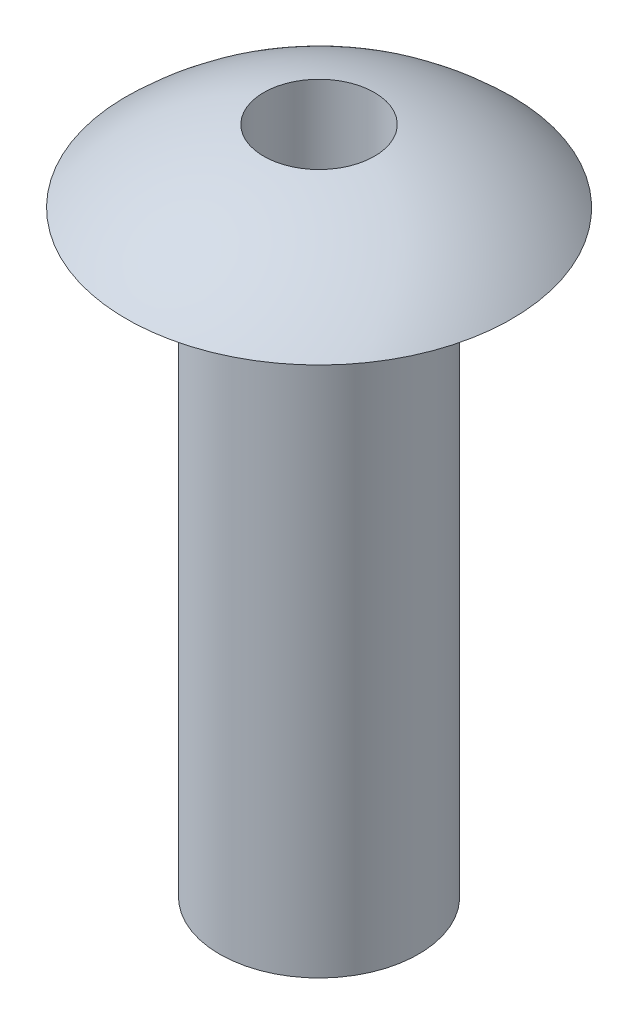
ISO-10303-21;
HEADER;
FILE_DESCRIPTION(('STEP AP214'),'2;1');
FILE_NAME('part.step','',(''),(''),'','','');
FILE_SCHEMA(('AUTOMOTIVE_DESIGN { 1 0 10303 214 1 1 1 1 }'));
ENDSEC;
DATA;
#1=APPLICATION_CONTEXT('core data for automotive mechanical design processes');
#2=APPLICATION_PROTOCOL_DEFINITION('international standard','automotive_design',2000,#1);
#3=PRODUCT_CONTEXT('',#1,'mechanical');
#4=PRODUCT('Part','Part','',(#3));
#5=PRODUCT_RELATED_PRODUCT_CATEGORY('part','',(#4));
#6=PRODUCT_DEFINITION_FORMATION('','',#4);
#7=PRODUCT_DEFINITION_CONTEXT('part definition',#1,'design');
#8=PRODUCT_DEFINITION('design','',#6,#7);
#9=PRODUCT_DEFINITION_SHAPE('','',#8);
#10=(LENGTH_UNIT() NAMED_UNIT(*) SI_UNIT(.MILLI.,.METRE.));
#11=(NAMED_UNIT(*) PLANE_ANGLE_UNIT() SI_UNIT($,.RADIAN.));
#12=(NAMED_UNIT(*) SI_UNIT($,.STERADIAN.) SOLID_ANGLE_UNIT());
#13=UNCERTAINTY_MEASURE_WITH_UNIT(LENGTH_MEASURE(1.E-05),#10,'distance_accuracy_value','');
#14=(GEOMETRIC_REPRESENTATION_CONTEXT(3) GLOBAL_UNCERTAINTY_ASSIGNED_CONTEXT((#13)) GLOBAL_UNIT_ASSIGNED_CONTEXT((#10,
#11,#12)) REPRESENTATION_CONTEXT('',''));
#15=CARTESIAN_POINT('',(0.,0.,0.));
#16=DIRECTION('',(0.,0.,1.));
#17=DIRECTION('',(1.,0.,0.));
#18=AXIS2_PLACEMENT_3D('',#15,#16,#17);
#19=CARTESIAN_POINT('',(0.,6.38099999999999,0.));
#20=DIRECTION('',(0.,-1.,0.));
#21=DIRECTION('',(1.,0.,0.));
#22=AXIS2_PLACEMENT_3D('',#19,#20,#21);
#23=SPHERICAL_SURFACE('',#22,4.46900000000001);
#24=CARTESIAN_POINT('',(0.,10.760481818663,0.));
#25=DIRECTION('',(0.,-1.,0.));
#26=DIRECTION('',(0.,0.,-1.));
#27=AXIS2_PLACEMENT_3D('',#24,#25,#26);
#28=CIRCLE('',#27,0.89);
#29=CARTESIAN_POINT('',(0.,10.760481818663,-0.89));
#30=VERTEX_POINT('',#29);
#31=EDGE_CURVE('E45',#30,#30,#28,.F.);
#32=ORIENTED_EDGE('',*,*,#31,.F.);
#33=EDGE_LOOP('',(#32));
#34=FACE_BOUND('',#33,.T.);
#35=CARTESIAN_POINT('',(0.,9.6,0.));
#36=DIRECTION('',(0.,-1.,0.));
#37=DIRECTION('',(0.,0.,-1.));
#38=AXIS2_PLACEMENT_3D('',#35,#36,#37);
#39=CIRCLE('',#38,3.1);
#40=CARTESIAN_POINT('',(0.,9.6,-3.1));
#41=VERTEX_POINT('',#40);
#42=EDGE_CURVE('E10',#41,#41,#39,.T.);
#43=ORIENTED_EDGE('',*,*,#42,.F.);
#44=EDGE_LOOP('',(#43));
#45=FACE_BOUND('',#44,.T.);
#46=ADVANCED_FACE('F31',(#34,#45),#23,.T.);
#47=CARTESIAN_POINT('',(1.6,9.6,0.));
#48=DIRECTION('',(0.,-1.,0.));
#49=DIRECTION('',(0.,0.,-1.));
#50=AXIS2_PLACEMENT_3D('',#47,#48,#49);
#51=PLANE('',#50);
#52=ORIENTED_EDGE('',*,*,#42,.T.);
#53=EDGE_LOOP('',(#52));
#54=FACE_BOUND('',#53,.T.);
#55=CARTESIAN_POINT('',(0.,9.6,0.));
#56=DIRECTION('',(0.,-1.,0.));
#57=DIRECTION('',(0.,0.,-1.));
#58=AXIS2_PLACEMENT_3D('',#55,#56,#57);
#59=CIRCLE('',#58,1.6);
#60=CARTESIAN_POINT('',(0.,9.6,-1.6));
#61=VERTEX_POINT('',#60);
#62=EDGE_CURVE('E37',#61,#61,#59,.T.);
#63=ORIENTED_EDGE('',*,*,#62,.F.);
#64=EDGE_LOOP('',(#63));
#65=FACE_BOUND('',#64,.T.);
#66=ADVANCED_FACE('F64',(#54,#65),#51,.T.);
#67=CARTESIAN_POINT('',(0.,0.,0.));
#68=DIRECTION('',(0.,-1.,0.));
#69=DIRECTION('',(0.,0.,-1.));
#70=AXIS2_PLACEMENT_3D('',#67,#68,#69);
#71=CYLINDRICAL_SURFACE('',#70,1.6);
#72=ORIENTED_EDGE('',*,*,#62,.T.);
#73=EDGE_LOOP('',(#72));
#74=FACE_BOUND('',#73,.T.);
#75=CARTESIAN_POINT('',(0.,0.,0.));
#76=DIRECTION('',(0.,-1.,0.));
#77=DIRECTION('',(0.,0.,-1.));
#78=AXIS2_PLACEMENT_3D('',#75,#76,#77);
#79=CIRCLE('',#78,1.6);
#80=CARTESIAN_POINT('',(0.,0.,-1.6));
#81=VERTEX_POINT('',#80);
#82=EDGE_CURVE('E41',#81,#81,#79,.T.);
#83=ORIENTED_EDGE('',*,*,#82,.F.);
#84=EDGE_LOOP('',(#83));
#85=FACE_BOUND('',#84,.T.);
#86=ADVANCED_FACE('F59',(#74,#85),#71,.T.);
#87=CARTESIAN_POINT('',(0.,0.,0.));
#88=DIRECTION('',(0.,-1.,0.));
#89=DIRECTION('',(0.,0.,-1.));
#90=AXIS2_PLACEMENT_3D('',#87,#88,#89);
#91=PLANE('',#90);
#92=CARTESIAN_POINT('',(0.,0.,0.));
#93=DIRECTION('',(0.,-1.,0.));
#94=DIRECTION('',(0.,0.,-1.));
#95=AXIS2_PLACEMENT_3D('',#92,#93,#94);
#96=CIRCLE('',#95,0.89);
#97=CARTESIAN_POINT('',(0.,0.,-0.89));
#98=VERTEX_POINT('',#97);
#99=EDGE_CURVE('E50',#98,#98,#96,.T.);
#100=ORIENTED_EDGE('',*,*,#99,.F.);
#101=EDGE_LOOP('',(#100));
#102=FACE_BOUND('',#101,.T.);
#103=ORIENTED_EDGE('',*,*,#82,.T.);
#104=EDGE_LOOP('',(#103));
#105=FACE_BOUND('',#104,.T.);
#106=ADVANCED_FACE('F56',(#102,#105),#91,.T.);
#107=CARTESIAN_POINT('',(0.,10.85,0.));
#108=DIRECTION('',(0.,-1.,0.));
#109=DIRECTION('',(0.,0.,-1.));
#110=AXIS2_PLACEMENT_3D('',#107,#108,#109);
#111=CYLINDRICAL_SURFACE('',#110,0.89);
#112=ORIENTED_EDGE('',*,*,#31,.T.);
#113=EDGE_LOOP('',(#112));
#114=FACE_BOUND('',#113,.T.);
#115=ORIENTED_EDGE('',*,*,#99,.T.);
#116=EDGE_LOOP('',(#115));
#117=FACE_BOUND('',#116,.T.);
#118=ADVANCED_FACE('F54',(#114,#117),#111,.F.);
#119=CLOSED_SHELL('',(#46,#66,#86,#106,#118));
#120=MANIFOLD_SOLID_BREP('B2',#119);
#121=ADVANCED_BREP_SHAPE_REPRESENTATION('',(#18,#120),#14);
#122=SHAPE_DEFINITION_REPRESENTATION(#9,#121);
ENDSEC;
END-ISO-10303-21;
